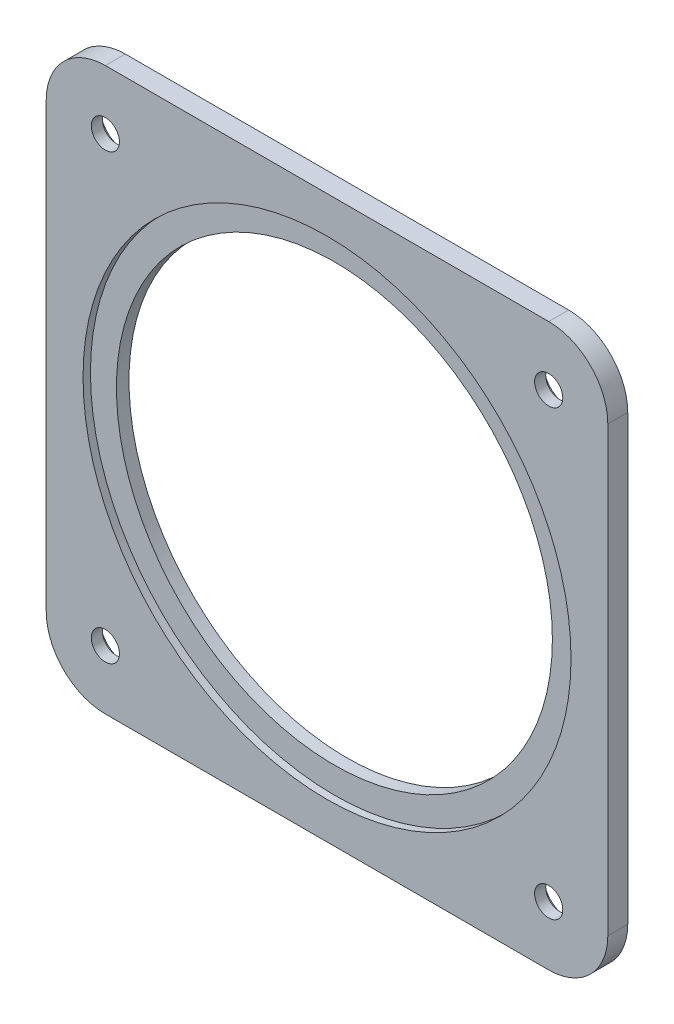
ISO-10303-21;
HEADER;
FILE_DESCRIPTION(('STEP AP214'),'2;1');
FILE_NAME('part.step','',(''),(''),'','','');
FILE_SCHEMA(('AUTOMOTIVE_DESIGN { 1 0 10303 214 1 1 1 1 }'));
ENDSEC;
DATA;
#1=APPLICATION_CONTEXT('core data for automotive mechanical design processes');
#2=APPLICATION_PROTOCOL_DEFINITION('international standard','automotive_design',2000,#1);
#3=PRODUCT_CONTEXT('',#1,'mechanical');
#4=PRODUCT('Part','Part','',(#3));
#5=PRODUCT_RELATED_PRODUCT_CATEGORY('part','',(#4));
#6=PRODUCT_DEFINITION_FORMATION('','',#4);
#7=PRODUCT_DEFINITION_CONTEXT('part definition',#1,'design');
#8=PRODUCT_DEFINITION('design','',#6,#7);
#9=PRODUCT_DEFINITION_SHAPE('','',#8);
#10=(LENGTH_UNIT() NAMED_UNIT(*) SI_UNIT(.MILLI.,.METRE.));
#11=(NAMED_UNIT(*) PLANE_ANGLE_UNIT() SI_UNIT($,.RADIAN.));
#12=(NAMED_UNIT(*) SI_UNIT($,.STERADIAN.) SOLID_ANGLE_UNIT());
#13=UNCERTAINTY_MEASURE_WITH_UNIT(LENGTH_MEASURE(1.E-05),#10,'distance_accuracy_value','');
#14=(GEOMETRIC_REPRESENTATION_CONTEXT(3) GLOBAL_UNCERTAINTY_ASSIGNED_CONTEXT((#13)) GLOBAL_UNIT_ASSIGNED_CONTEXT((#10,
#11,#12)) REPRESENTATION_CONTEXT('',''));
#15=CARTESIAN_POINT('',(0.,0.,0.));
#16=DIRECTION('',(0.,0.,1.));
#17=DIRECTION('',(1.,0.,0.));
#18=AXIS2_PLACEMENT_3D('',#15,#16,#17);
#19=CARTESIAN_POINT('',(0.,0.,6.75));
#20=DIRECTION('',(0.,0.,-1.));
#21=DIRECTION('',(-1.,0.,0.));
#22=AXIS2_PLACEMENT_3D('',#19,#20,#21);
#23=CYLINDRICAL_SURFACE('',#22,73.75);
#24=CARTESIAN_POINT('',(0.,0.,0.));
#25=DIRECTION('',(0.,0.,1.));
#26=DIRECTION('',(1.,0.,0.));
#27=AXIS2_PLACEMENT_3D('',#24,#25,#26);
#28=CIRCLE('',#27,73.75);
#29=CARTESIAN_POINT('',(73.75,0.,0.));
#30=VERTEX_POINT('',#29);
#31=EDGE_CURVE('E152',#30,#30,#28,.T.);
#32=ORIENTED_EDGE('',*,*,#31,.F.);
#33=EDGE_LOOP('',(#32));
#34=FACE_BOUND('',#33,.T.);
#35=CARTESIAN_POINT('',(0.,0.,4.25));
#36=DIRECTION('',(0.,0.,1.));
#37=DIRECTION('',(1.,0.,0.));
#38=AXIS2_PLACEMENT_3D('',#35,#36,#37);
#39=CIRCLE('',#38,73.75);
#40=CARTESIAN_POINT('',(73.75,0.,4.25));
#41=VERTEX_POINT('',#40);
#42=EDGE_CURVE('E46',#41,#41,#39,.T.);
#43=ORIENTED_EDGE('',*,*,#42,.T.);
#44=EDGE_LOOP('',(#43));
#45=FACE_BOUND('',#44,.T.);
#46=ADVANCED_FACE('F42',(#34,#45),#23,.F.);
#47=CARTESIAN_POINT('',(-75.,74.9999999999999,6.75));
#48=DIRECTION('',(0.,0.,-1.));
#49=DIRECTION('',(-1.,0.,0.));
#50=AXIS2_PLACEMENT_3D('',#47,#48,#49);
#51=CYLINDRICAL_SURFACE('',#50,4.7625);
#52=CARTESIAN_POINT('',(-75.,74.9999999999999,6.75));
#53=DIRECTION('',(0.,0.,1.));
#54=DIRECTION('',(1.,0.,0.));
#55=AXIS2_PLACEMENT_3D('',#52,#53,#54);
#56=CIRCLE('',#55,4.7625);
#57=CARTESIAN_POINT('',(-70.2375,74.9999999999999,6.75));
#58=VERTEX_POINT('',#57);
#59=EDGE_CURVE('E223',#58,#58,#56,.T.);
#60=ORIENTED_EDGE('',*,*,#59,.T.);
#61=EDGE_LOOP('',(#60));
#62=FACE_BOUND('',#61,.T.);
#63=CARTESIAN_POINT('',(-75.,74.9999999999999,3.));
#64=DIRECTION('',(0.,0.,-1.));
#65=DIRECTION('',(-1.,0.,0.));
#66=AXIS2_PLACEMENT_3D('',#63,#64,#65);
#67=CIRCLE('',#66,4.7625);
#68=CARTESIAN_POINT('',(-79.7625,74.9999999999999,3.));
#69=VERTEX_POINT('',#68);
#70=EDGE_CURVE('E200',#69,#69,#67,.T.);
#71=ORIENTED_EDGE('',*,*,#70,.T.);
#72=EDGE_LOOP('',(#71));
#73=FACE_BOUND('',#72,.T.);
#74=ADVANCED_FACE('F272',(#62,#73),#51,.F.);
#75=CARTESIAN_POINT('',(75.0000000000002,74.9999999999997,6.75));
#76=DIRECTION('',(0.,0.,-1.));
#77=DIRECTION('',(-1.,0.,0.));
#78=AXIS2_PLACEMENT_3D('',#75,#76,#77);
#79=CYLINDRICAL_SURFACE('',#78,4.76249999999999);
#80=CARTESIAN_POINT('',(75.0000000000002,74.9999999999997,6.75));
#81=DIRECTION('',(0.,0.,1.));
#82=DIRECTION('',(1.,0.,0.));
#83=AXIS2_PLACEMENT_3D('',#80,#81,#82);
#84=CIRCLE('',#83,4.76249999999999);
#85=CARTESIAN_POINT('',(79.7625000000002,74.9999999999997,6.75));
#86=VERTEX_POINT('',#85);
#87=EDGE_CURVE('E214',#86,#86,#84,.T.);
#88=ORIENTED_EDGE('',*,*,#87,.T.);
#89=EDGE_LOOP('',(#88));
#90=FACE_BOUND('',#89,.T.);
#91=CARTESIAN_POINT('',(75.0000000000002,74.9999999999997,3.));
#92=DIRECTION('',(0.,0.,-1.));
#93=DIRECTION('',(-1.,0.,0.));
#94=AXIS2_PLACEMENT_3D('',#91,#92,#93);
#95=CIRCLE('',#94,4.76249999999999);
#96=CARTESIAN_POINT('',(70.2375000000002,74.9999999999997,3.));
#97=VERTEX_POINT('',#96);
#98=EDGE_CURVE('E197',#97,#97,#95,.T.);
#99=ORIENTED_EDGE('',*,*,#98,.T.);
#100=EDGE_LOOP('',(#99));
#101=FACE_BOUND('',#100,.T.);
#102=ADVANCED_FACE('F278',(#90,#101),#79,.F.);
#103=CARTESIAN_POINT('',(74.9999999999995,-75.0000000000005,6.75));
#104=DIRECTION('',(0.,0.,-1.));
#105=DIRECTION('',(-1.,0.,0.));
#106=AXIS2_PLACEMENT_3D('',#103,#104,#105);
#107=CYLINDRICAL_SURFACE('',#106,4.76249999999998);
#108=CARTESIAN_POINT('',(74.9999999999995,-75.0000000000005,6.75));
#109=DIRECTION('',(0.,0.,1.));
#110=DIRECTION('',(1.,0.,0.));
#111=AXIS2_PLACEMENT_3D('',#108,#109,#110);
#112=CIRCLE('',#111,4.76249999999998);
#113=CARTESIAN_POINT('',(79.7624999999995,-75.0000000000005,6.75));
#114=VERTEX_POINT('',#113);
#115=EDGE_CURVE('E208',#114,#114,#112,.T.);
#116=ORIENTED_EDGE('',*,*,#115,.T.);
#117=EDGE_LOOP('',(#116));
#118=FACE_BOUND('',#117,.T.);
#119=CARTESIAN_POINT('',(74.9999999999995,-75.0000000000005,3.));
#120=DIRECTION('',(0.,0.,-1.));
#121=DIRECTION('',(-1.,0.,0.));
#122=AXIS2_PLACEMENT_3D('',#119,#120,#121);
#123=CIRCLE('',#122,4.76249999999998);
#124=CARTESIAN_POINT('',(70.2374999999995,-75.0000000000005,3.));
#125=VERTEX_POINT('',#124);
#126=EDGE_CURVE('E192',#125,#125,#123,.T.);
#127=ORIENTED_EDGE('',*,*,#126,.T.);
#128=EDGE_LOOP('',(#127));
#129=FACE_BOUND('',#128,.T.);
#130=ADVANCED_FACE('F388',(#118,#129),#107,.F.);
#131=CARTESIAN_POINT('',(-75.0000000000007,-74.9999999999992,6.75));
#132=DIRECTION('',(0.,0.,-1.));
#133=DIRECTION('',(-1.,0.,0.));
#134=AXIS2_PLACEMENT_3D('',#131,#132,#133);
#135=CYLINDRICAL_SURFACE('',#134,4.76249999999999);
#136=CARTESIAN_POINT('',(-75.0000000000007,-74.9999999999992,6.75));
#137=DIRECTION('',(0.,0.,1.));
#138=DIRECTION('',(1.,0.,0.));
#139=AXIS2_PLACEMENT_3D('',#136,#137,#138);
#140=CIRCLE('',#139,4.76249999999999);
#141=CARTESIAN_POINT('',(-70.2375000000008,-74.9999999999992,6.75));
#142=VERTEX_POINT('',#141);
#143=EDGE_CURVE('E203',#142,#142,#140,.T.);
#144=ORIENTED_EDGE('',*,*,#143,.T.);
#145=EDGE_LOOP('',(#144));
#146=FACE_BOUND('',#145,.T.);
#147=CARTESIAN_POINT('',(-75.0000000000007,-74.9999999999992,3.));
#148=DIRECTION('',(0.,0.,-1.));
#149=DIRECTION('',(-1.,0.,0.));
#150=AXIS2_PLACEMENT_3D('',#147,#148,#149);
#151=CIRCLE('',#150,4.76249999999999);
#152=CARTESIAN_POINT('',(-79.7625000000007,-74.9999999999992,3.));
#153=VERTEX_POINT('',#152);
#154=EDGE_CURVE('E188',#153,#153,#151,.T.);
#155=ORIENTED_EDGE('',*,*,#154,.T.);
#156=EDGE_LOOP('',(#155));
#157=FACE_BOUND('',#156,.T.);
#158=ADVANCED_FACE('F286',(#146,#157),#135,.F.);
#159=CARTESIAN_POINT('',(-75.,-75.,6.75));
#160=DIRECTION('',(0.,0.,-1.));
#161=DIRECTION('',(-1.,0.,0.));
#162=AXIS2_PLACEMENT_3D('',#159,#160,#161);
#163=PLANE('',#162);
#164=CARTESIAN_POINT('',(0.,0.,6.75));
#165=DIRECTION('',(0.,0.,1.));
#166=DIRECTION('',(1.,0.,0.));
#167=AXIS2_PLACEMENT_3D('',#164,#165,#166);
#168=CIRCLE('',#167,82.55);
#169=CARTESIAN_POINT('',(82.55,0.,6.75));
#170=VERTEX_POINT('',#169);
#171=EDGE_CURVE('E320',#170,#170,#168,.T.);
#172=ORIENTED_EDGE('',*,*,#171,.F.);
#173=EDGE_LOOP('',(#172));
#174=FACE_BOUND('',#173,.T.);
#175=CARTESIAN_POINT('',(-75.,-75.,6.75));
#176=DIRECTION('',(0.,0.,1.));
#177=DIRECTION('',(-1.,0.,0.));
#178=AXIS2_PLACEMENT_3D('',#175,#176,#177);
#179=CIRCLE('',#178,20.);
#180=CARTESIAN_POINT('',(-95.,-74.9999999999999,6.75));
#181=VERTEX_POINT('',#180);
#182=CARTESIAN_POINT('',(-74.9999999999998,-95.,6.75));
#183=VERTEX_POINT('',#182);
#184=EDGE_CURVE('E170',#181,#183,#179,.T.);
#185=ORIENTED_EDGE('',*,*,#184,.T.);
#186=DIRECTION('',(1.,0.,0.));
#187=VECTOR('',#186,1.);
#188=CARTESIAN_POINT('',(74.9999999999999,-95.,6.75));
#189=LINE('',#188,#187);
#190=CARTESIAN_POINT('',(74.9999999999999,-95.,6.75));
#191=VERTEX_POINT('',#190);
#192=EDGE_CURVE('E105',#183,#191,#189,.T.);
#193=ORIENTED_EDGE('',*,*,#192,.T.);
#194=CARTESIAN_POINT('',(75.,-75.,6.75));
#195=DIRECTION('',(0.,0.,1.));
#196=DIRECTION('',(1.,0.,0.));
#197=AXIS2_PLACEMENT_3D('',#194,#195,#196);
#198=CIRCLE('',#197,20.);
#199=CARTESIAN_POINT('',(95.,-75.,6.75));
#200=VERTEX_POINT('',#199);
#201=EDGE_CURVE('E234',#191,#200,#198,.T.);
#202=ORIENTED_EDGE('',*,*,#201,.T.);
#203=DIRECTION('',(0.,1.,0.));
#204=VECTOR('',#203,1.);
#205=CARTESIAN_POINT('',(95.,-74.9999999999998,6.75));
#206=LINE('',#205,#204);
#207=CARTESIAN_POINT('',(95.,74.9999999999999,6.75));
#208=VERTEX_POINT('',#207);
#209=EDGE_CURVE('E237',#200,#208,#206,.T.);
#210=ORIENTED_EDGE('',*,*,#209,.T.);
#211=CARTESIAN_POINT('',(75.,75.,6.75));
#212=DIRECTION('',(0.,0.,1.));
#213=DIRECTION('',(1.,0.,0.));
#214=AXIS2_PLACEMENT_3D('',#211,#212,#213);
#215=CIRCLE('',#214,20.);
#216=CARTESIAN_POINT('',(74.9999999999999,95.,6.75));
#217=VERTEX_POINT('',#216);
#218=EDGE_CURVE('E125',#208,#217,#215,.T.);
#219=ORIENTED_EDGE('',*,*,#218,.T.);
#220=DIRECTION('',(-1.,0.,0.));
#221=VECTOR('',#220,1.);
#222=CARTESIAN_POINT('',(74.9999999999999,95.,6.75));
#223=LINE('',#222,#221);
#224=CARTESIAN_POINT('',(-74.9999999999998,95.,6.75));
#225=VERTEX_POINT('',#224);
#226=EDGE_CURVE('E118',#217,#225,#223,.T.);
#227=ORIENTED_EDGE('',*,*,#226,.T.);
#228=CARTESIAN_POINT('',(-75.,75.,6.75));
#229=DIRECTION('',(0.,0.,1.));
#230=DIRECTION('',(1.,0.,0.));
#231=AXIS2_PLACEMENT_3D('',#228,#229,#230);
#232=CIRCLE('',#231,20.);
#233=CARTESIAN_POINT('',(-95.,74.9999999999999,6.75));
#234=VERTEX_POINT('',#233);
#235=EDGE_CURVE('E123',#225,#234,#232,.T.);
#236=ORIENTED_EDGE('',*,*,#235,.T.);
#237=DIRECTION('',(0.,-1.,0.));
#238=VECTOR('',#237,1.);
#239=CARTESIAN_POINT('',(-95.,-74.9999999999999,6.75));
#240=LINE('',#239,#238);
#241=EDGE_CURVE('E62',#234,#181,#240,.T.);
#242=ORIENTED_EDGE('',*,*,#241,.T.);
#243=EDGE_LOOP('',(#185,#193,#202,#210,#219,#227,#236,#242));
#244=FACE_BOUND('',#243,.T.);
#245=ORIENTED_EDGE('',*,*,#59,.F.);
#246=EDGE_LOOP('',(#245));
#247=FACE_BOUND('',#246,.T.);
#248=ORIENTED_EDGE('',*,*,#87,.F.);
#249=EDGE_LOOP('',(#248));
#250=FACE_BOUND('',#249,.T.);
#251=ORIENTED_EDGE('',*,*,#115,.F.);
#252=EDGE_LOOP('',(#251));
#253=FACE_BOUND('',#252,.T.);
#254=ORIENTED_EDGE('',*,*,#143,.F.);
#255=EDGE_LOOP('',(#254));
#256=FACE_BOUND('',#255,.T.);
#257=ADVANCED_FACE('F120',(#174,#244,#247,#250,#253,#256),#163,.F.);
#258=CARTESIAN_POINT('',(-75.,-75.,0.));
#259=DIRECTION('',(0.,0.,-1.));
#260=DIRECTION('',(-1.,0.,0.));
#261=AXIS2_PLACEMENT_3D('',#258,#259,#260);
#262=PLANE('',#261);
#263=CARTESIAN_POINT('',(75.0000000000005,-74.9999999999994,0.));
#264=DIRECTION('',(0.,0.,-1.));
#265=DIRECTION('',(-1.,0.,0.));
#266=AXIS2_PLACEMENT_3D('',#263,#264,#265);
#267=CIRCLE('',#266,8.5);
#268=CARTESIAN_POINT('',(66.5000000000005,-74.9999999999994,0.));
#269=VERTEX_POINT('',#268);
#270=EDGE_CURVE('E297',#269,#269,#267,.T.);
#271=ORIENTED_EDGE('',*,*,#270,.F.);
#272=EDGE_LOOP('',(#271));
#273=FACE_BOUND('',#272,.T.);
#274=CARTESIAN_POINT('',(-74.9999999999997,-75.0000000000003,0.));
#275=DIRECTION('',(0.,0.,-1.));
#276=DIRECTION('',(-1.,0.,0.));
#277=AXIS2_PLACEMENT_3D('',#274,#275,#276);
#278=CIRCLE('',#277,8.50000000000001);
#279=CARTESIAN_POINT('',(-83.4999999999997,-75.0000000000003,0.));
#280=VERTEX_POINT('',#279);
#281=EDGE_CURVE('E301',#280,#280,#278,.T.);
#282=ORIENTED_EDGE('',*,*,#281,.F.);
#283=EDGE_LOOP('',(#282));
#284=FACE_BOUND('',#283,.T.);
#285=CARTESIAN_POINT('',(-75.,74.9999999999999,0.));
#286=DIRECTION('',(0.,0.,-1.));
#287=DIRECTION('',(-1.,0.,0.));
#288=AXIS2_PLACEMENT_3D('',#285,#286,#287);
#289=CIRCLE('',#288,8.5);
#290=CARTESIAN_POINT('',(-83.5,74.9999999999999,0.));
#291=VERTEX_POINT('',#290);
#292=EDGE_CURVE('E305',#291,#291,#289,.T.);
#293=ORIENTED_EDGE('',*,*,#292,.F.);
#294=EDGE_LOOP('',(#293));
#295=FACE_BOUND('',#294,.T.);
#296=CARTESIAN_POINT('',(75.0000000000002,74.9999999999997,0.));
#297=DIRECTION('',(0.,0.,-1.));
#298=DIRECTION('',(-1.,0.,0.));
#299=AXIS2_PLACEMENT_3D('',#296,#297,#298);
#300=CIRCLE('',#299,8.50000000000001);
#301=CARTESIAN_POINT('',(66.5000000000002,74.9999999999997,0.));
#302=VERTEX_POINT('',#301);
#303=EDGE_CURVE('E217',#302,#302,#300,.T.);
#304=ORIENTED_EDGE('',*,*,#303,.F.);
#305=EDGE_LOOP('',(#304));
#306=FACE_BOUND('',#305,.T.);
#307=CARTESIAN_POINT('',(-75.,-75.,0.));
#308=DIRECTION('',(0.,0.,1.));
#309=DIRECTION('',(-1.,0.,0.));
#310=AXIS2_PLACEMENT_3D('',#307,#308,#309);
#311=CIRCLE('',#310,20.);
#312=CARTESIAN_POINT('',(-95.,-74.9999999999999,0.));
#313=VERTEX_POINT('',#312);
#314=CARTESIAN_POINT('',(-74.9999999999998,-95.,0.));
#315=VERTEX_POINT('',#314);
#316=EDGE_CURVE('E147',#313,#315,#311,.T.);
#317=ORIENTED_EDGE('',*,*,#316,.F.);
#318=DIRECTION('',(0.,-1.,0.));
#319=VECTOR('',#318,1.);
#320=CARTESIAN_POINT('',(-95.,-74.9999999999999,0.));
#321=LINE('',#320,#319);
#322=CARTESIAN_POINT('',(-95.,74.9999999999999,0.));
#323=VERTEX_POINT('',#322);
#324=EDGE_CURVE('E97',#323,#313,#321,.T.);
#325=ORIENTED_EDGE('',*,*,#324,.F.);
#326=CARTESIAN_POINT('',(-75.,75.,0.));
#327=DIRECTION('',(0.,0.,1.));
#328=DIRECTION('',(1.,0.,0.));
#329=AXIS2_PLACEMENT_3D('',#326,#327,#328);
#330=CIRCLE('',#329,20.);
#331=CARTESIAN_POINT('',(-74.9999999999998,95.,0.));
#332=VERTEX_POINT('',#331);
#333=EDGE_CURVE('E91',#332,#323,#330,.T.);
#334=ORIENTED_EDGE('',*,*,#333,.F.);
#335=DIRECTION('',(-1.,0.,0.));
#336=VECTOR('',#335,1.);
#337=CARTESIAN_POINT('',(74.9999999999999,95.,0.));
#338=LINE('',#337,#336);
#339=CARTESIAN_POINT('',(74.9999999999999,95.,0.));
#340=VERTEX_POINT('',#339);
#341=EDGE_CURVE('E134',#340,#332,#338,.T.);
#342=ORIENTED_EDGE('',*,*,#341,.F.);
#343=CARTESIAN_POINT('',(75.,75.,0.));
#344=DIRECTION('',(0.,0.,1.));
#345=DIRECTION('',(1.,0.,0.));
#346=AXIS2_PLACEMENT_3D('',#343,#344,#345);
#347=CIRCLE('',#346,20.);
#348=CARTESIAN_POINT('',(95.,74.9999999999999,0.));
#349=VERTEX_POINT('',#348);
#350=EDGE_CURVE('E161',#349,#340,#347,.T.);
#351=ORIENTED_EDGE('',*,*,#350,.F.);
#352=DIRECTION('',(0.,1.,0.));
#353=VECTOR('',#352,1.);
#354=CARTESIAN_POINT('',(95.,-74.9999999999998,0.));
#355=LINE('',#354,#353);
#356=CARTESIAN_POINT('',(95.,-75.,0.));
#357=VERTEX_POINT('',#356);
#358=EDGE_CURVE('E158',#357,#349,#355,.T.);
#359=ORIENTED_EDGE('',*,*,#358,.F.);
#360=CARTESIAN_POINT('',(75.,-75.,0.));
#361=DIRECTION('',(0.,0.,1.));
#362=DIRECTION('',(1.,0.,0.));
#363=AXIS2_PLACEMENT_3D('',#360,#361,#362);
#364=CIRCLE('',#363,20.);
#365=CARTESIAN_POINT('',(74.9999999999999,-95.,0.));
#366=VERTEX_POINT('',#365);
#367=EDGE_CURVE('E155',#366,#357,#364,.T.);
#368=ORIENTED_EDGE('',*,*,#367,.F.);
#369=DIRECTION('',(1.,0.,0.));
#370=VECTOR('',#369,1.);
#371=CARTESIAN_POINT('',(74.9999999999999,-95.,0.));
#372=LINE('',#371,#370);
#373=EDGE_CURVE('E151',#315,#366,#372,.T.);
#374=ORIENTED_EDGE('',*,*,#373,.F.);
#375=EDGE_LOOP('',(#317,#325,#334,#342,#351,#359,#368,#374));
#376=FACE_BOUND('',#375,.T.);
#377=ORIENTED_EDGE('',*,*,#31,.T.);
#378=EDGE_LOOP('',(#377));
#379=FACE_BOUND('',#378,.T.);
#380=ADVANCED_FACE('F252',(#273,#284,#295,#306,#376,#379),#262,.T.);
#381=CARTESIAN_POINT('',(-75.,-75.,6.75));
#382=DIRECTION('',(0.,0.,-1.));
#383=DIRECTION('',(-1.,0.,0.));
#384=AXIS2_PLACEMENT_3D('',#381,#382,#383);
#385=CYLINDRICAL_SURFACE('',#384,20.);
#386=ORIENTED_EDGE('',*,*,#316,.T.);
#387=DIRECTION('',(0.,0.,-1.));
#388=VECTOR('',#387,1.);
#389=CARTESIAN_POINT('',(-74.9999999999998,-95.,6.75));
#390=LINE('',#389,#388);
#391=EDGE_CURVE('E11',#183,#315,#390,.T.);
#392=ORIENTED_EDGE('',*,*,#391,.F.);
#393=ORIENTED_EDGE('',*,*,#184,.F.);
#394=DIRECTION('',(0.,0.,-1.));
#395=VECTOR('',#394,1.);
#396=CARTESIAN_POINT('',(-95.,-74.9999999999999,6.75));
#397=LINE('',#396,#395);
#398=EDGE_CURVE('E143',#181,#313,#397,.T.);
#399=ORIENTED_EDGE('',*,*,#398,.T.);
#400=EDGE_LOOP('',(#386,#392,#393,#399));
#401=FACE_BOUND('',#400,.T.);
#402=ADVANCED_FACE('F44',(#401),#385,.T.);
#403=CARTESIAN_POINT('',(74.9999999999999,-95.,6.75));
#404=DIRECTION('',(0.,1.,0.));
#405=DIRECTION('',(-1.,0.,0.));
#406=AXIS2_PLACEMENT_3D('',#403,#404,#405);
#407=PLANE('',#406);
#408=ORIENTED_EDGE('',*,*,#373,.T.);
#409=DIRECTION('',(0.,0.,-1.));
#410=VECTOR('',#409,1.);
#411=CARTESIAN_POINT('',(74.9999999999999,-95.,6.75));
#412=LINE('',#411,#410);
#413=EDGE_CURVE('E53',#191,#366,#412,.T.);
#414=ORIENTED_EDGE('',*,*,#413,.F.);
#415=ORIENTED_EDGE('',*,*,#192,.F.);
#416=ORIENTED_EDGE('',*,*,#391,.T.);
#417=EDGE_LOOP('',(#408,#414,#415,#416));
#418=FACE_BOUND('',#417,.T.);
#419=ADVANCED_FACE('F293',(#418),#407,.F.);
#420=CARTESIAN_POINT('',(75.,-75.,6.75));
#421=DIRECTION('',(0.,0.,-1.));
#422=DIRECTION('',(-1.,0.,0.));
#423=AXIS2_PLACEMENT_3D('',#420,#421,#422);
#424=CYLINDRICAL_SURFACE('',#423,20.);
#425=ORIENTED_EDGE('',*,*,#367,.T.);
#426=DIRECTION('',(0.,0.,-1.));
#427=VECTOR('',#426,1.);
#428=CARTESIAN_POINT('',(95.,-75.,6.75));
#429=LINE('',#428,#427);
#430=EDGE_CURVE('E181',#200,#357,#429,.T.);
#431=ORIENTED_EDGE('',*,*,#430,.F.);
#432=ORIENTED_EDGE('',*,*,#201,.F.);
#433=ORIENTED_EDGE('',*,*,#413,.T.);
#434=EDGE_LOOP('',(#425,#431,#432,#433));
#435=FACE_BOUND('',#434,.T.);
#436=ADVANCED_FACE('F544',(#435),#424,.T.);
#437=CARTESIAN_POINT('',(95.,-74.9999999999998,6.75));
#438=DIRECTION('',(-1.,0.,0.));
#439=DIRECTION('',(0.,0.,1.));
#440=AXIS2_PLACEMENT_3D('',#437,#438,#439);
#441=PLANE('',#440);
#442=ORIENTED_EDGE('',*,*,#358,.T.);
#443=DIRECTION('',(0.,0.,-1.));
#444=VECTOR('',#443,1.);
#445=CARTESIAN_POINT('',(95.,74.9999999999999,6.75));
#446=LINE('',#445,#444);
#447=EDGE_CURVE('E177',#208,#349,#446,.T.);
#448=ORIENTED_EDGE('',*,*,#447,.F.);
#449=ORIENTED_EDGE('',*,*,#209,.F.);
#450=ORIENTED_EDGE('',*,*,#430,.T.);
#451=EDGE_LOOP('',(#442,#448,#449,#450));
#452=FACE_BOUND('',#451,.T.);
#453=ADVANCED_FACE('F245',(#452),#441,.F.);
#454=CARTESIAN_POINT('',(75.,75.,6.75));
#455=DIRECTION('',(0.,0.,-1.));
#456=DIRECTION('',(-1.,0.,0.));
#457=AXIS2_PLACEMENT_3D('',#454,#455,#456);
#458=CYLINDRICAL_SURFACE('',#457,20.);
#459=ORIENTED_EDGE('',*,*,#350,.T.);
#460=DIRECTION('',(0.,0.,-1.));
#461=VECTOR('',#460,1.);
#462=CARTESIAN_POINT('',(74.9999999999999,95.,6.75));
#463=LINE('',#462,#461);
#464=EDGE_CURVE('E136',#217,#340,#463,.T.);
#465=ORIENTED_EDGE('',*,*,#464,.F.);
#466=ORIENTED_EDGE('',*,*,#218,.F.);
#467=ORIENTED_EDGE('',*,*,#447,.T.);
#468=EDGE_LOOP('',(#459,#465,#466,#467));
#469=FACE_BOUND('',#468,.T.);
#470=ADVANCED_FACE('F249',(#469),#458,.T.);
#471=CARTESIAN_POINT('',(74.9999999999999,95.,6.75));
#472=DIRECTION('',(0.,-1.,0.));
#473=DIRECTION('',(1.,0.,0.));
#474=AXIS2_PLACEMENT_3D('',#471,#472,#473);
#475=PLANE('',#474);
#476=ORIENTED_EDGE('',*,*,#341,.T.);
#477=DIRECTION('',(0.,0.,-1.));
#478=VECTOR('',#477,1.);
#479=CARTESIAN_POINT('',(-74.9999999999998,95.,6.75));
#480=LINE('',#479,#478);
#481=EDGE_CURVE('E131',#225,#332,#480,.T.);
#482=ORIENTED_EDGE('',*,*,#481,.F.);
#483=ORIENTED_EDGE('',*,*,#226,.F.);
#484=ORIENTED_EDGE('',*,*,#464,.T.);
#485=EDGE_LOOP('',(#476,#482,#483,#484));
#486=FACE_BOUND('',#485,.T.);
#487=ADVANCED_FACE('F132',(#486),#475,.F.);
#488=CARTESIAN_POINT('',(-75.,75.,6.75));
#489=DIRECTION('',(0.,0.,-1.));
#490=DIRECTION('',(-1.,0.,0.));
#491=AXIS2_PLACEMENT_3D('',#488,#489,#490);
#492=CYLINDRICAL_SURFACE('',#491,20.);
#493=ORIENTED_EDGE('',*,*,#333,.T.);
#494=DIRECTION('',(0.,0.,-1.));
#495=VECTOR('',#494,1.);
#496=CARTESIAN_POINT('',(-95.,74.9999999999999,6.75));
#497=LINE('',#496,#495);
#498=EDGE_CURVE('E137',#234,#323,#497,.T.);
#499=ORIENTED_EDGE('',*,*,#498,.F.);
#500=ORIENTED_EDGE('',*,*,#235,.F.);
#501=ORIENTED_EDGE('',*,*,#481,.T.);
#502=EDGE_LOOP('',(#493,#499,#500,#501));
#503=FACE_BOUND('',#502,.T.);
#504=ADVANCED_FACE('F139',(#503),#492,.T.);
#505=CARTESIAN_POINT('',(-95.,-74.9999999999999,6.75));
#506=DIRECTION('',(1.,0.,0.));
#507=DIRECTION('',(0.,0.,-1.));
#508=AXIS2_PLACEMENT_3D('',#505,#506,#507);
#509=PLANE('',#508);
#510=ORIENTED_EDGE('',*,*,#324,.T.);
#511=ORIENTED_EDGE('',*,*,#398,.F.);
#512=ORIENTED_EDGE('',*,*,#241,.F.);
#513=ORIENTED_EDGE('',*,*,#498,.T.);
#514=EDGE_LOOP('',(#510,#511,#512,#513));
#515=FACE_BOUND('',#514,.T.);
#516=ADVANCED_FACE('F258',(#515),#509,.F.);
#517=CARTESIAN_POINT('',(-74.9999999999997,-75.0000000000003,3.));
#518=DIRECTION('',(0.,0.,-1.));
#519=DIRECTION('',(-1.,0.,0.));
#520=AXIS2_PLACEMENT_3D('',#517,#518,#519);
#521=CYLINDRICAL_SURFACE('',#520,8.50000000000001);
#522=CARTESIAN_POINT('',(-74.9999999999997,-75.0000000000003,3.));
#523=DIRECTION('',(0.,0.,-1.));
#524=DIRECTION('',(-1.,0.,0.));
#525=AXIS2_PLACEMENT_3D('',#522,#523,#524);
#526=CIRCLE('',#525,8.50000000000001);
#527=CARTESIAN_POINT('',(-83.4999999999997,-75.0000000000003,3.));
#528=VERTEX_POINT('',#527);
#529=EDGE_CURVE('E325',#528,#528,#526,.T.);
#530=ORIENTED_EDGE('',*,*,#529,.F.);
#531=EDGE_LOOP('',(#530));
#532=FACE_BOUND('',#531,.T.);
#533=ORIENTED_EDGE('',*,*,#281,.T.);
#534=EDGE_LOOP('',(#533));
#535=FACE_BOUND('',#534,.T.);
#536=ADVANCED_FACE('F260',(#532,#535),#521,.F.);
#537=CARTESIAN_POINT('',(-74.9999999999997,-75.0000000000003,3.));
#538=DIRECTION('',(0.,0.,-1.));
#539=DIRECTION('',(-1.,0.,0.));
#540=AXIS2_PLACEMENT_3D('',#537,#538,#539);
#541=PLANE('',#540);
#542=ORIENTED_EDGE('',*,*,#154,.F.);
#543=EDGE_LOOP('',(#542));
#544=FACE_BOUND('',#543,.T.);
#545=ORIENTED_EDGE('',*,*,#529,.T.);
#546=EDGE_LOOP('',(#545));
#547=FACE_BOUND('',#546,.T.);
#548=ADVANCED_FACE('F266',(#544,#547),#541,.T.);
#549=CARTESIAN_POINT('',(75.0000000000005,-74.9999999999994,3.));
#550=DIRECTION('',(0.,0.,-1.));
#551=DIRECTION('',(-1.,0.,0.));
#552=AXIS2_PLACEMENT_3D('',#549,#550,#551);
#553=CYLINDRICAL_SURFACE('',#552,8.5);
#554=CARTESIAN_POINT('',(75.0000000000005,-74.9999999999994,3.));
#555=DIRECTION('',(0.,0.,-1.));
#556=DIRECTION('',(-1.,0.,0.));
#557=AXIS2_PLACEMENT_3D('',#554,#555,#556);
#558=CIRCLE('',#557,8.5);
#559=CARTESIAN_POINT('',(66.5000000000005,-74.9999999999994,3.));
#560=VERTEX_POINT('',#559);
#561=EDGE_CURVE('E331',#560,#560,#558,.T.);
#562=ORIENTED_EDGE('',*,*,#561,.F.);
#563=EDGE_LOOP('',(#562));
#564=FACE_BOUND('',#563,.T.);
#565=ORIENTED_EDGE('',*,*,#270,.T.);
#566=EDGE_LOOP('',(#565));
#567=FACE_BOUND('',#566,.T.);
#568=ADVANCED_FACE('F370',(#564,#567),#553,.F.);
#569=CARTESIAN_POINT('',(75.0000000000005,-74.9999999999994,3.));
#570=DIRECTION('',(0.,0.,-1.));
#571=DIRECTION('',(-1.,0.,0.));
#572=AXIS2_PLACEMENT_3D('',#569,#570,#571);
#573=PLANE('',#572);
#574=ORIENTED_EDGE('',*,*,#126,.F.);
#575=EDGE_LOOP('',(#574));
#576=FACE_BOUND('',#575,.T.);
#577=ORIENTED_EDGE('',*,*,#561,.T.);
#578=EDGE_LOOP('',(#577));
#579=FACE_BOUND('',#578,.T.);
#580=ADVANCED_FACE('F374',(#576,#579),#573,.T.);
#581=CARTESIAN_POINT('',(75.0000000000002,74.9999999999997,3.));
#582=DIRECTION('',(0.,0.,-1.));
#583=DIRECTION('',(-1.,0.,0.));
#584=AXIS2_PLACEMENT_3D('',#581,#582,#583);
#585=CYLINDRICAL_SURFACE('',#584,8.50000000000001);
#586=CARTESIAN_POINT('',(75.0000000000002,74.9999999999997,3.));
#587=DIRECTION('',(0.,0.,-1.));
#588=DIRECTION('',(-1.,0.,0.));
#589=AXIS2_PLACEMENT_3D('',#586,#587,#588);
#590=CIRCLE('',#589,8.50000000000001);
#591=CARTESIAN_POINT('',(66.5000000000002,74.9999999999997,3.));
#592=VERTEX_POINT('',#591);
#593=EDGE_CURVE('E193',#592,#592,#590,.T.);
#594=ORIENTED_EDGE('',*,*,#593,.F.);
#595=EDGE_LOOP('',(#594));
#596=FACE_BOUND('',#595,.T.);
#597=ORIENTED_EDGE('',*,*,#303,.T.);
#598=EDGE_LOOP('',(#597));
#599=FACE_BOUND('',#598,.T.);
#600=ADVANCED_FACE('F378',(#596,#599),#585,.F.);
#601=CARTESIAN_POINT('',(75.0000000000002,74.9999999999997,3.));
#602=DIRECTION('',(0.,0.,-1.));
#603=DIRECTION('',(-1.,0.,0.));
#604=AXIS2_PLACEMENT_3D('',#601,#602,#603);
#605=PLANE('',#604);
#606=ORIENTED_EDGE('',*,*,#98,.F.);
#607=EDGE_LOOP('',(#606));
#608=FACE_BOUND('',#607,.T.);
#609=ORIENTED_EDGE('',*,*,#593,.T.);
#610=EDGE_LOOP('',(#609));
#611=FACE_BOUND('',#610,.T.);
#612=ADVANCED_FACE('F365',(#608,#611),#605,.T.);
#613=CARTESIAN_POINT('',(-75.,74.9999999999999,3.));
#614=DIRECTION('',(0.,0.,-1.));
#615=DIRECTION('',(-1.,0.,0.));
#616=AXIS2_PLACEMENT_3D('',#613,#614,#615);
#617=CYLINDRICAL_SURFACE('',#616,8.5);
#618=CARTESIAN_POINT('',(-75.,74.9999999999999,3.));
#619=DIRECTION('',(0.,0.,-1.));
#620=DIRECTION('',(-1.,0.,0.));
#621=AXIS2_PLACEMENT_3D('',#618,#619,#620);
#622=CIRCLE('',#621,8.5);
#623=CARTESIAN_POINT('',(-83.5,74.9999999999999,3.));
#624=VERTEX_POINT('',#623);
#625=EDGE_CURVE('E313',#624,#624,#622,.T.);
#626=ORIENTED_EDGE('',*,*,#625,.F.);
#627=EDGE_LOOP('',(#626));
#628=FACE_BOUND('',#627,.T.);
#629=ORIENTED_EDGE('',*,*,#292,.T.);
#630=EDGE_LOOP('',(#629));
#631=FACE_BOUND('',#630,.T.);
#632=ADVANCED_FACE('F360',(#628,#631),#617,.F.);
#633=CARTESIAN_POINT('',(-75.,74.9999999999999,3.));
#634=DIRECTION('',(0.,0.,-1.));
#635=DIRECTION('',(-1.,0.,0.));
#636=AXIS2_PLACEMENT_3D('',#633,#634,#635);
#637=PLANE('',#636);
#638=ORIENTED_EDGE('',*,*,#70,.F.);
#639=EDGE_LOOP('',(#638));
#640=FACE_BOUND('',#639,.T.);
#641=ORIENTED_EDGE('',*,*,#625,.T.);
#642=EDGE_LOOP('',(#641));
#643=FACE_BOUND('',#642,.T.);
#644=ADVANCED_FACE('F351',(#640,#643),#637,.T.);
#645=CARTESIAN_POINT('',(0.,0.,4.25));
#646=DIRECTION('',(0.,0.,1.));
#647=DIRECTION('',(1.,0.,0.));
#648=AXIS2_PLACEMENT_3D('',#645,#646,#647);
#649=CYLINDRICAL_SURFACE('',#648,82.55);
#650=CARTESIAN_POINT('',(0.,0.,4.25));
#651=DIRECTION('',(0.,0.,1.));
#652=DIRECTION('',(1.,0.,0.));
#653=AXIS2_PLACEMENT_3D('',#650,#651,#652);
#654=CIRCLE('',#653,82.55);
#655=CARTESIAN_POINT('',(82.55,0.,4.25));
#656=VERTEX_POINT('',#655);
#657=EDGE_CURVE('E338',#656,#656,#654,.T.);
#658=ORIENTED_EDGE('',*,*,#657,.F.);
#659=EDGE_LOOP('',(#658));
#660=FACE_BOUND('',#659,.T.);
#661=ORIENTED_EDGE('',*,*,#171,.T.);
#662=EDGE_LOOP('',(#661));
#663=FACE_BOUND('',#662,.T.);
#664=ADVANCED_FACE('F348',(#660,#663),#649,.F.);
#665=CARTESIAN_POINT('',(0.,0.,4.25));
#666=DIRECTION('',(0.,0.,1.));
#667=DIRECTION('',(1.,0.,0.));
#668=AXIS2_PLACEMENT_3D('',#665,#666,#667);
#669=PLANE('',#668);
#670=ORIENTED_EDGE('',*,*,#42,.F.);
#671=EDGE_LOOP('',(#670));
#672=FACE_BOUND('',#671,.T.);
#673=ORIENTED_EDGE('',*,*,#657,.T.);
#674=EDGE_LOOP('',(#673));
#675=FACE_BOUND('',#674,.T.);
#676=ADVANCED_FACE('F350',(#672,#675),#669,.T.);
#677=CLOSED_SHELL('',(#46,#74,#102,#130,#158,#257,#380,#402,#419,#436,#453,#470,#487,#504,#516,
#536,#548,#568,#580,#600,#612,#632,#644,#664,#676));
#678=MANIFOLD_SOLID_BREP('B2',#677);
#679=ADVANCED_BREP_SHAPE_REPRESENTATION('',(#18,#678),#14);
#680=SHAPE_DEFINITION_REPRESENTATION(#9,#679);
ENDSEC;
END-ISO-10303-21;
